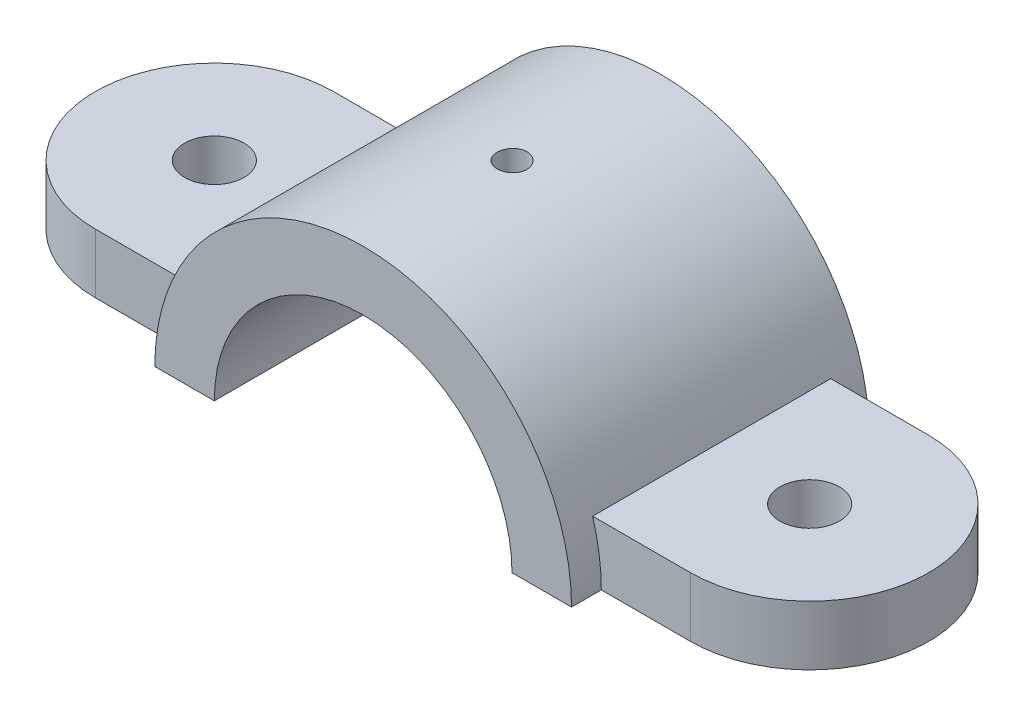
ISO-10303-21;
HEADER;
FILE_DESCRIPTION(('STEP AP214'),'2;1');
FILE_NAME('part.step','',(''),(''),'','','');
FILE_SCHEMA(('AUTOMOTIVE_DESIGN { 1 0 10303 214 1 1 1 1 }'));
ENDSEC;
DATA;
#1=APPLICATION_CONTEXT('core data for automotive mechanical design processes');
#2=APPLICATION_PROTOCOL_DEFINITION('international standard','automotive_design',2000,#1);
#3=PRODUCT_CONTEXT('',#1,'mechanical');
#4=PRODUCT('Part','Part','',(#3));
#5=PRODUCT_RELATED_PRODUCT_CATEGORY('part','',(#4));
#6=PRODUCT_DEFINITION_FORMATION('','',#4);
#7=PRODUCT_DEFINITION_CONTEXT('part definition',#1,'design');
#8=PRODUCT_DEFINITION('design','',#6,#7);
#9=PRODUCT_DEFINITION_SHAPE('','',#8);
#10=(LENGTH_UNIT() NAMED_UNIT(*) SI_UNIT(.MILLI.,.METRE.));
#11=(NAMED_UNIT(*) PLANE_ANGLE_UNIT() SI_UNIT($,.RADIAN.));
#12=(NAMED_UNIT(*) SI_UNIT($,.STERADIAN.) SOLID_ANGLE_UNIT());
#13=UNCERTAINTY_MEASURE_WITH_UNIT(LENGTH_MEASURE(1.E-05),#10,'distance_accuracy_value','');
#14=(GEOMETRIC_REPRESENTATION_CONTEXT(3) GLOBAL_UNCERTAINTY_ASSIGNED_CONTEXT((#13)) GLOBAL_UNIT_ASSIGNED_CONTEXT((#10,
#11,#12)) REPRESENTATION_CONTEXT('',''));
#15=CARTESIAN_POINT('',(0.,0.,0.));
#16=DIRECTION('',(0.,0.,1.));
#17=DIRECTION('',(1.,0.,0.));
#18=AXIS2_PLACEMENT_3D('',#15,#16,#17);
#19=CARTESIAN_POINT('',(-63.5,0.,0.));
#20=DIRECTION('',(0.,1.,0.));
#21=DIRECTION('',(0.,0.,1.));
#22=AXIS2_PLACEMENT_3D('',#19,#20,#21);
#23=PLANE('',#22);
#24=CARTESIAN_POINT('',(-63.5,0.,4.20088608509321E-13));
#25=DIRECTION('',(0.,1.,0.));
#26=DIRECTION('',(0.,0.,-1.));
#27=AXIS2_PLACEMENT_3D('',#24,#25,#26);
#28=CIRCLE('',#27,6.34999999999998);
#29=CARTESIAN_POINT('',(-63.5,0.,-6.34999999999956));
#30=VERTEX_POINT('',#29);
#31=EDGE_CURVE('E178',#30,#30,#28,.T.);
#32=ORIENTED_EDGE('',*,*,#31,.T.);
#33=EDGE_LOOP('',(#32));
#34=FACE_BOUND('',#33,.T.);
#35=DIRECTION('',(1.,0.,0.));
#36=VECTOR('',#35,1.);
#37=CARTESIAN_POINT('',(-44.45,0.,-31.75));
#38=LINE('',#37,#36);
#39=CARTESIAN_POINT('',(-44.45,0.,-31.75));
#40=VERTEX_POINT('',#39);
#41=CARTESIAN_POINT('',(-31.75,0.,-31.75));
#42=VERTEX_POINT('',#41);
#43=EDGE_CURVE('E153',#40,#42,#38,.T.);
#44=ORIENTED_EDGE('',*,*,#43,.T.);
#45=DIRECTION('',(0.,0.,1.));
#46=VECTOR('',#45,1.);
#47=CARTESIAN_POINT('',(-31.75,0.,-31.75));
#48=LINE('',#47,#46);
#49=CARTESIAN_POINT('',(-31.75,0.,31.75));
#50=VERTEX_POINT('',#49);
#51=EDGE_CURVE('E55',#42,#50,#48,.T.);
#52=ORIENTED_EDGE('',*,*,#51,.T.);
#53=DIRECTION('',(1.,0.,0.));
#54=VECTOR('',#53,1.);
#55=CARTESIAN_POINT('',(-44.45,0.,31.75));
#56=LINE('',#55,#54);
#57=CARTESIAN_POINT('',(-44.45,0.,31.75));
#58=VERTEX_POINT('',#57);
#59=EDGE_CURVE('E296',#58,#50,#56,.T.);
#60=ORIENTED_EDGE('',*,*,#59,.F.);
#61=DIRECTION('',(0.,0.,-1.));
#62=VECTOR('',#61,1.);
#63=CARTESIAN_POINT('',(-44.45,0.,31.75));
#64=LINE('',#63,#62);
#65=CARTESIAN_POINT('',(-44.45,0.,25.4));
#66=VERTEX_POINT('',#65);
#67=EDGE_CURVE('E164',#58,#66,#64,.T.);
#68=ORIENTED_EDGE('',*,*,#67,.T.);
#69=DIRECTION('',(1.,0.,0.));
#70=VECTOR('',#69,1.);
#71=CARTESIAN_POINT('',(-63.5,0.,25.4));
#72=LINE('',#71,#70);
#73=CARTESIAN_POINT('',(-63.5,0.,25.4));
#74=VERTEX_POINT('',#73);
#75=EDGE_CURVE('E204',#74,#66,#72,.T.);
#76=ORIENTED_EDGE('',*,*,#75,.F.);
#77=CARTESIAN_POINT('',(-63.5,0.,0.));
#78=DIRECTION('',(0.,1.,0.));
#79=DIRECTION('',(0.,0.,1.));
#80=AXIS2_PLACEMENT_3D('',#77,#78,#79);
#81=CIRCLE('',#80,25.4);
#82=CARTESIAN_POINT('',(-63.5,0.,-25.4));
#83=VERTEX_POINT('',#82);
#84=EDGE_CURVE('E184',#83,#74,#81,.T.);
#85=ORIENTED_EDGE('',*,*,#84,.F.);
#86=DIRECTION('',(-1.,0.,0.));
#87=VECTOR('',#86,1.);
#88=CARTESIAN_POINT('',(-63.5,0.,-25.4));
#89=LINE('',#88,#87);
#90=CARTESIAN_POINT('',(-44.45,0.,-25.4));
#91=VERTEX_POINT('',#90);
#92=EDGE_CURVE('E208',#91,#83,#89,.T.);
#93=ORIENTED_EDGE('',*,*,#92,.F.);
#94=EDGE_CURVE('E162',#91,#40,#64,.T.);
#95=ORIENTED_EDGE('',*,*,#94,.T.);
#96=EDGE_LOOP('',(#44,#52,#60,#68,#76,#85,#93,#95));
#97=FACE_BOUND('',#96,.T.);
#98=ADVANCED_FACE('F34',(#34,#97),#23,.F.);
#99=CARTESIAN_POINT('',(-63.5,12.7,0.));
#100=DIRECTION('',(0.,1.,0.));
#101=DIRECTION('',(0.,0.,1.));
#102=AXIS2_PLACEMENT_3D('',#99,#100,#101);
#103=PLANE('',#102);
#104=CARTESIAN_POINT('',(63.5,12.7,0.));
#105=DIRECTION('',(0.,1.,0.));
#106=DIRECTION('',(0.,0.,1.));
#107=AXIS2_PLACEMENT_3D('',#104,#105,#106);
#108=CIRCLE('',#107,6.35);
#109=CARTESIAN_POINT('',(63.5,12.7,6.34999999999997));
#110=VERTEX_POINT('',#109);
#111=EDGE_CURVE('E181',#110,#110,#108,.T.);
#112=ORIENTED_EDGE('',*,*,#111,.F.);
#113=EDGE_LOOP('',(#112));
#114=FACE_BOUND('',#113,.T.);
#115=DIRECTION('',(-1.,0.,0.));
#116=VECTOR('',#115,1.);
#117=CARTESIAN_POINT('',(-63.5,12.7,-25.4));
#118=LINE('',#117,#116);
#119=CARTESIAN_POINT('',(63.5,12.7,-25.4));
#120=VERTEX_POINT('',#119);
#121=CARTESIAN_POINT('',(42.597094971371,12.7,-25.4));
#122=VERTEX_POINT('',#121);
#123=EDGE_CURVE('E198',#120,#122,#118,.T.);
#124=ORIENTED_EDGE('',*,*,#123,.T.);
#125=DIRECTION('',(0.,0.,-1.));
#126=VECTOR('',#125,1.);
#127=CARTESIAN_POINT('',(42.597094971371,12.7,31.75));
#128=LINE('',#127,#126);
#129=CARTESIAN_POINT('',(42.597094971371,12.7,25.4));
#130=VERTEX_POINT('',#129);
#131=EDGE_CURVE('E63',#122,#130,#128,.F.);
#132=ORIENTED_EDGE('',*,*,#131,.T.);
#133=DIRECTION('',(1.,0.,0.));
#134=VECTOR('',#133,1.);
#135=CARTESIAN_POINT('',(-63.5,12.7,25.4));
#136=LINE('',#135,#134);
#137=CARTESIAN_POINT('',(63.5,12.7,25.4));
#138=VERTEX_POINT('',#137);
#139=EDGE_CURVE('E190',#130,#138,#136,.T.);
#140=ORIENTED_EDGE('',*,*,#139,.T.);
#141=CARTESIAN_POINT('',(63.5,12.7,0.));
#142=DIRECTION('',(0.,1.,0.));
#143=DIRECTION('',(0.,0.,1.));
#144=AXIS2_PLACEMENT_3D('',#141,#142,#143);
#145=CIRCLE('',#144,25.4);
#146=EDGE_CURVE('E195',#138,#120,#145,.T.);
#147=ORIENTED_EDGE('',*,*,#146,.T.);
#148=EDGE_LOOP('',(#124,#132,#140,#147));
#149=FACE_BOUND('',#148,.T.);
#150=ADVANCED_FACE('F245',(#114,#149),#103,.T.);
#151=CARTESIAN_POINT('',(-63.5,12.7,4.20088608509321E-13));
#152=DIRECTION('',(0.,1.,0.));
#153=DIRECTION('',(0.,0.,-1.));
#154=AXIS2_PLACEMENT_3D('',#151,#152,#153);
#155=CIRCLE('',#154,6.34999999999998);
#156=CARTESIAN_POINT('',(-63.5,12.7,-6.34999999999956));
#157=VERTEX_POINT('',#156);
#158=EDGE_CURVE('E174',#157,#157,#155,.T.);
#159=ORIENTED_EDGE('',*,*,#158,.F.);
#160=EDGE_LOOP('',(#159));
#161=FACE_BOUND('',#160,.T.);
#162=CARTESIAN_POINT('',(-63.5,12.7,25.4));
#163=VERTEX_POINT('',#162);
#164=CARTESIAN_POINT('',(-42.597094971371,12.7,25.4));
#165=VERTEX_POINT('',#164);
#166=EDGE_CURVE('E192',#163,#165,#136,.T.);
#167=ORIENTED_EDGE('',*,*,#166,.T.);
#168=DIRECTION('',(0.,0.,-1.));
#169=VECTOR('',#168,1.);
#170=CARTESIAN_POINT('',(-42.597094971371,12.7,31.75));
#171=LINE('',#170,#169);
#172=CARTESIAN_POINT('',(-42.597094971371,12.7,-25.4));
#173=VERTEX_POINT('',#172);
#174=EDGE_CURVE('E171',#165,#173,#171,.T.);
#175=ORIENTED_EDGE('',*,*,#174,.T.);
#176=CARTESIAN_POINT('',(-63.5,12.7,-25.4));
#177=VERTEX_POINT('',#176);
#178=EDGE_CURVE('E197',#173,#177,#118,.T.);
#179=ORIENTED_EDGE('',*,*,#178,.T.);
#180=CARTESIAN_POINT('',(-63.5,12.7,0.));
#181=DIRECTION('',(0.,1.,0.));
#182=DIRECTION('',(0.,0.,1.));
#183=AXIS2_PLACEMENT_3D('',#180,#181,#182);
#184=CIRCLE('',#183,25.4);
#185=EDGE_CURVE('E187',#177,#163,#184,.T.);
#186=ORIENTED_EDGE('',*,*,#185,.T.);
#187=EDGE_LOOP('',(#167,#175,#179,#186));
#188=FACE_BOUND('',#187,.T.);
#189=ADVANCED_FACE('F251',(#161,#188),#103,.T.);
#190=CARTESIAN_POINT('',(-63.5,12.7,25.4));
#191=DIRECTION('',(0.,0.,-1.));
#192=DIRECTION('',(-1.,0.,0.));
#193=AXIS2_PLACEMENT_3D('',#190,#191,#192);
#194=PLANE('',#193);
#195=CARTESIAN_POINT('',(0.,0.,25.4));
#196=DIRECTION('',(0.,0.,-1.));
#197=DIRECTION('',(-1.,0.,0.));
#198=AXIS2_PLACEMENT_3D('',#195,#196,#197);
#199=CIRCLE('',#198,44.45);
#200=CARTESIAN_POINT('',(44.45,0.,25.4));
#201=VERTEX_POINT('',#200);
#202=EDGE_CURVE('E168',#201,#130,#199,.F.);
#203=ORIENTED_EDGE('',*,*,#202,.F.);
#204=CARTESIAN_POINT('',(63.5,0.,25.4));
#205=VERTEX_POINT('',#204);
#206=EDGE_CURVE('E203',#201,#205,#72,.T.);
#207=ORIENTED_EDGE('',*,*,#206,.T.);
#208=DIRECTION('',(0.,-1.,0.));
#209=VECTOR('',#208,1.);
#210=CARTESIAN_POINT('',(63.5,12.7,25.4));
#211=LINE('',#210,#209);
#212=EDGE_CURVE('E215',#138,#205,#211,.T.);
#213=ORIENTED_EDGE('',*,*,#212,.F.);
#214=ORIENTED_EDGE('',*,*,#139,.F.);
#215=EDGE_LOOP('',(#203,#207,#213,#214));
#216=FACE_BOUND('',#215,.T.);
#217=ADVANCED_FACE('F275',(#216),#194,.F.);
#218=EDGE_CURVE('E172',#165,#66,#199,.F.);
#219=ORIENTED_EDGE('',*,*,#218,.F.);
#220=ORIENTED_EDGE('',*,*,#166,.F.);
#221=DIRECTION('',(0.,-1.,0.));
#222=VECTOR('',#221,1.);
#223=CARTESIAN_POINT('',(-63.5,12.7,25.4));
#224=LINE('',#223,#222);
#225=EDGE_CURVE('E218',#163,#74,#224,.T.);
#226=ORIENTED_EDGE('',*,*,#225,.T.);
#227=ORIENTED_EDGE('',*,*,#75,.T.);
#228=EDGE_LOOP('',(#219,#220,#226,#227));
#229=FACE_BOUND('',#228,.T.);
#230=ADVANCED_FACE('F269',(#229),#194,.F.);
#231=CARTESIAN_POINT('',(-63.5,12.7,-25.4));
#232=DIRECTION('',(0.,0.,1.));
#233=DIRECTION('',(1.,0.,0.));
#234=AXIS2_PLACEMENT_3D('',#231,#232,#233);
#235=PLANE('',#234);
#236=CARTESIAN_POINT('',(0.,0.,-25.4));
#237=DIRECTION('',(0.,0.,1.));
#238=DIRECTION('',(1.,0.,0.));
#239=AXIS2_PLACEMENT_3D('',#236,#237,#238);
#240=CIRCLE('',#239,44.45);
#241=EDGE_CURVE('E48',#91,#173,#240,.F.);
#242=ORIENTED_EDGE('',*,*,#241,.F.);
#243=ORIENTED_EDGE('',*,*,#92,.T.);
#244=DIRECTION('',(0.,-1.,0.));
#245=VECTOR('',#244,1.);
#246=CARTESIAN_POINT('',(-63.5,12.7,-25.4));
#247=LINE('',#246,#245);
#248=EDGE_CURVE('E200',#177,#83,#247,.T.);
#249=ORIENTED_EDGE('',*,*,#248,.F.);
#250=ORIENTED_EDGE('',*,*,#178,.F.);
#251=EDGE_LOOP('',(#242,#243,#249,#250));
#252=FACE_BOUND('',#251,.T.);
#253=ADVANCED_FACE('F264',(#252),#235,.F.);
#254=CARTESIAN_POINT('',(44.45,0.,-25.4));
#255=VERTEX_POINT('',#254);
#256=EDGE_CURVE('E221',#122,#255,#240,.F.);
#257=ORIENTED_EDGE('',*,*,#256,.F.);
#258=ORIENTED_EDGE('',*,*,#123,.F.);
#259=DIRECTION('',(0.,-1.,0.));
#260=VECTOR('',#259,1.);
#261=CARTESIAN_POINT('',(63.5,12.7,-25.4));
#262=LINE('',#261,#260);
#263=CARTESIAN_POINT('',(63.5,0.,-25.4));
#264=VERTEX_POINT('',#263);
#265=EDGE_CURVE('E212',#120,#264,#262,.T.);
#266=ORIENTED_EDGE('',*,*,#265,.T.);
#267=EDGE_CURVE('E191',#264,#255,#89,.T.);
#268=ORIENTED_EDGE('',*,*,#267,.T.);
#269=EDGE_LOOP('',(#257,#258,#266,#268));
#270=FACE_BOUND('',#269,.T.);
#271=ADVANCED_FACE('F257',(#270),#235,.F.);
#272=CARTESIAN_POINT('',(31.75,0.,31.75));
#273=VERTEX_POINT('',#272);
#274=CARTESIAN_POINT('',(44.45,0.,31.75));
#275=VERTEX_POINT('',#274);
#276=EDGE_CURVE('E147',#273,#275,#56,.T.);
#277=ORIENTED_EDGE('',*,*,#276,.F.);
#278=DIRECTION('',(0.,0.,1.));
#279=VECTOR('',#278,1.);
#280=CARTESIAN_POINT('',(31.75,0.,-31.75));
#281=LINE('',#280,#279);
#282=CARTESIAN_POINT('',(31.75,0.,-31.75));
#283=VERTEX_POINT('',#282);
#284=EDGE_CURVE('E131',#283,#273,#281,.T.);
#285=ORIENTED_EDGE('',*,*,#284,.F.);
#286=CARTESIAN_POINT('',(44.45,0.,-31.75));
#287=VERTEX_POINT('',#286);
#288=EDGE_CURVE('E144',#283,#287,#38,.T.);
#289=ORIENTED_EDGE('',*,*,#288,.T.);
#290=DIRECTION('',(0.,0.,-1.));
#291=VECTOR('',#290,1.);
#292=CARTESIAN_POINT('',(44.45,0.,31.75));
#293=LINE('',#292,#291);
#294=EDGE_CURVE('E163',#255,#287,#293,.T.);
#295=ORIENTED_EDGE('',*,*,#294,.F.);
#296=ORIENTED_EDGE('',*,*,#267,.F.);
#297=CARTESIAN_POINT('',(63.5,0.,0.));
#298=DIRECTION('',(0.,1.,0.));
#299=DIRECTION('',(0.,0.,1.));
#300=AXIS2_PLACEMENT_3D('',#297,#298,#299);
#301=CIRCLE('',#300,25.4);
#302=EDGE_CURVE('E206',#205,#264,#301,.T.);
#303=ORIENTED_EDGE('',*,*,#302,.F.);
#304=ORIENTED_EDGE('',*,*,#206,.F.);
#305=EDGE_CURVE('E159',#275,#201,#293,.T.);
#306=ORIENTED_EDGE('',*,*,#305,.F.);
#307=EDGE_LOOP('',(#277,#285,#289,#295,#296,#303,#304,#306));
#308=FACE_BOUND('',#307,.T.);
#309=CARTESIAN_POINT('',(63.5,0.,0.));
#310=DIRECTION('',(0.,1.,0.));
#311=DIRECTION('',(0.,0.,1.));
#312=AXIS2_PLACEMENT_3D('',#309,#310,#311);
#313=CIRCLE('',#312,6.35);
#314=CARTESIAN_POINT('',(63.5,0.,6.34999999999997));
#315=VERTEX_POINT('',#314);
#316=EDGE_CURVE('E177',#315,#315,#313,.T.);
#317=ORIENTED_EDGE('',*,*,#316,.T.);
#318=EDGE_LOOP('',(#317));
#319=FACE_BOUND('',#318,.T.);
#320=ADVANCED_FACE('F141',(#308,#319),#23,.F.);
#321=CARTESIAN_POINT('',(-63.5,12.7,0.));
#322=DIRECTION('',(0.,-1.,0.));
#323=DIRECTION('',(0.,0.,-1.));
#324=AXIS2_PLACEMENT_3D('',#321,#322,#323);
#325=CYLINDRICAL_SURFACE('',#324,25.4);
#326=ORIENTED_EDGE('',*,*,#84,.T.);
#327=ORIENTED_EDGE('',*,*,#225,.F.);
#328=ORIENTED_EDGE('',*,*,#185,.F.);
#329=ORIENTED_EDGE('',*,*,#248,.T.);
#330=EDGE_LOOP('',(#326,#327,#328,#329));
#331=FACE_BOUND('',#330,.T.);
#332=ADVANCED_FACE('F36',(#331),#325,.T.);
#333=CARTESIAN_POINT('',(63.5,12.7,0.));
#334=DIRECTION('',(0.,-1.,0.));
#335=DIRECTION('',(0.,0.,-1.));
#336=AXIS2_PLACEMENT_3D('',#333,#334,#335);
#337=CYLINDRICAL_SURFACE('',#336,25.4);
#338=ORIENTED_EDGE('',*,*,#302,.T.);
#339=ORIENTED_EDGE('',*,*,#265,.F.);
#340=ORIENTED_EDGE('',*,*,#146,.F.);
#341=ORIENTED_EDGE('',*,*,#212,.T.);
#342=EDGE_LOOP('',(#338,#339,#340,#341));
#343=FACE_BOUND('',#342,.T.);
#344=ADVANCED_FACE('F262',(#343),#337,.T.);
#345=CARTESIAN_POINT('',(63.5,12.7,0.));
#346=DIRECTION('',(0.,-1.,0.));
#347=DIRECTION('',(0.,0.,-1.));
#348=AXIS2_PLACEMENT_3D('',#345,#346,#347);
#349=CYLINDRICAL_SURFACE('',#348,6.35);
#350=ORIENTED_EDGE('',*,*,#111,.T.);
#351=EDGE_LOOP('',(#350));
#352=FACE_BOUND('',#351,.T.);
#353=ORIENTED_EDGE('',*,*,#316,.F.);
#354=EDGE_LOOP('',(#353));
#355=FACE_BOUND('',#354,.T.);
#356=ADVANCED_FACE('F273',(#352,#355),#349,.F.);
#357=CARTESIAN_POINT('',(-63.5,12.7,4.20088608509321E-13));
#358=DIRECTION('',(0.,-1.,0.));
#359=DIRECTION('',(0.,0.,-1.));
#360=AXIS2_PLACEMENT_3D('',#357,#358,#359);
#361=CYLINDRICAL_SURFACE('',#360,6.34999999999998);
#362=ORIENTED_EDGE('',*,*,#158,.T.);
#363=EDGE_LOOP('',(#362));
#364=FACE_BOUND('',#363,.T.);
#365=ORIENTED_EDGE('',*,*,#31,.F.);
#366=EDGE_LOOP('',(#365));
#367=FACE_BOUND('',#366,.T.);
#368=ADVANCED_FACE('F312',(#364,#367),#361,.F.);
#369=CARTESIAN_POINT('',(0.,0.,31.75));
#370=DIRECTION('',(0.,0.,-1.));
#371=DIRECTION('',(-1.,0.,0.));
#372=AXIS2_PLACEMENT_3D('',#369,#370,#371);
#373=CYLINDRICAL_SURFACE('',#372,44.45);
#374=CARTESIAN_POINT('',(0.,44.45,-3.175));
#375=CARTESIAN_POINT('',(0.17809755969062,44.4499985010204,-3.1749921852915));
#376=CARTESIAN_POINT('',(0.35631846093859,44.4489181935322,-3.15996439283334));
#377=CARTESIAN_POINT('',(0.707835270978344,44.4447124952987,-3.10023344384521));
#378=CARTESIAN_POINT('',(0.881125267556108,44.4415847492453,-3.05549610954538));
#379=CARTESIAN_POINT('',(1.21763791674399,44.4336378558182,-2.9376410589189));
#380=CARTESIAN_POINT('',(1.38086597659549,44.4288196263855,-2.86453874264178));
#381=CARTESIAN_POINT('',(1.69269346722433,44.418033060304,-2.69205484914637));
#382=CARTESIAN_POINT('',(1.84129615082639,44.4120649802704,-2.59267913359277));
#383=CARTESIAN_POINT('',(2.11997998340939,44.3996363409005,-2.37026268279305));
#384=CARTESIAN_POINT('',(2.25002939260178,44.3931749659727,-2.24718222035807));
#385=CARTESIAN_POINT('',(2.48764317829891,44.380494884107,-1.9809330348178));
#386=CARTESIAN_POINT('',(2.5952065966931,44.3742761875187,-1.83776345616511));
#387=CARTESIAN_POINT('',(2.78489768412392,44.3627762652838,-1.53521415441453));
#388=CARTESIAN_POINT('',(2.86699822922461,44.3574960418693,-1.37581738390362));
#389=CARTESIAN_POINT('',(3.00325964148284,44.3484793632232,-1.04545759664348));
#390=CARTESIAN_POINT('',(3.05742088477707,44.3447428872087,-0.874494735639384));
#391=CARTESIAN_POINT('',(3.13617617440064,44.3392430145078,-0.526167808778249));
#392=CARTESIAN_POINT('',(3.16082095687461,44.337476232457,-0.348815268475376));
#393=CARTESIAN_POINT('',(3.18000042163169,44.3361048630515,0.00751738406976762));
#394=CARTESIAN_POINT('',(3.17453553300967,44.3365002448835,0.186497473081446));
#395=CARTESIAN_POINT('',(3.1336928080948,44.3394054749584,0.540658150616265));
#396=CARTESIAN_POINT('',(3.09836996539516,44.3419114358203,0.715845117472151));
#397=CARTESIAN_POINT('',(2.9988993736118,44.3487493276067,1.05779706955871));
#398=CARTESIAN_POINT('',(2.93475140879975,44.353081272197,1.22456199174809));
#399=CARTESIAN_POINT('',(2.7793894028839,44.3630874612053,1.54511214283126));
#400=CARTESIAN_POINT('',(2.68815052276378,44.3687629365025,1.69888529294486));
#401=CARTESIAN_POINT('',(2.4812145802267,44.3808154538232,1.98895478384996));
#402=CARTESIAN_POINT('',(2.36551715598193,44.3871925062249,2.12525086604629));
#403=CARTESIAN_POINT('',(2.11263912589021,44.3999468565423,2.37681715563404));
#404=CARTESIAN_POINT('',(1.97541094694941,44.4063241229682,2.49203954889323));
#405=CARTESIAN_POINT('',(1.68353326582272,44.4183465899756,2.69781856552779));
#406=CARTESIAN_POINT('',(1.52888375563627,44.4239917902211,2.7883751775756));
#407=CARTESIAN_POINT('',(1.20652351982174,44.4339147067992,2.94224843922552));
#408=CARTESIAN_POINT('',(1.03881186894526,44.4381923261505,3.00556315708914));
#409=CARTESIAN_POINT('',(0.695101534536752,44.4448968658532,3.10312281529963));
#410=CARTESIAN_POINT('',(0.519102977405436,44.4473238144234,3.13736819889142));
#411=CARTESIAN_POINT('',(0.164229470601715,44.4500499204039,3.17575756562761));
#412=CARTESIAN_POINT('',(-0.0146382961204218,44.4503537489791,3.17996763115629));
#413=CARTESIAN_POINT('',(-0.370537321569539,44.4488118249658,3.15833969363806));
#414=CARTESIAN_POINT('',(-0.547568592818348,44.4469660870436,3.13250189560341));
#415=CARTESIAN_POINT('',(-0.894582312960256,44.4413357347358,3.05156640913193));
#416=CARTESIAN_POINT('',(-1.06457189733486,44.4375531376683,2.99649916218023));
#417=CARTESIAN_POINT('',(-1.39289741703371,44.4284743676534,2.85869891892336));
#418=CARTESIAN_POINT('',(-1.5512332159126,44.423178176988,2.77596559875991));
#419=CARTESIAN_POINT('',(-1.85205847074147,44.4116551142492,2.58501432949461));
#420=CARTESIAN_POINT('',(-1.99451993838108,44.4054266423692,2.47675238551611));
#421=CARTESIAN_POINT('',(-2.25927051769905,44.3927448859707,2.23788087230796));
#422=CARTESIAN_POINT('',(-2.38155937133055,44.3862915985778,2.10727101724873));
#423=CARTESIAN_POINT('',(-2.60271836127946,44.3738738792979,1.82712545316469));
#424=CARTESIAN_POINT('',(-2.70154552685789,44.3679103572931,1.67755577532192));
#425=CARTESIAN_POINT('',(-2.87268159958821,44.3571593354335,1.36390636365055));
#426=CARTESIAN_POINT('',(-2.94499071056565,44.3523718265397,1.19982674136168));
#427=CARTESIAN_POINT('',(-3.06096414564601,44.3445193603726,0.861970119106408));
#428=CARTESIAN_POINT('',(-3.10465522282774,44.3414527946903,0.688202341357345));
#429=CARTESIAN_POINT('',(-3.16223963020726,44.3373836261545,0.335774660840801));
#430=CARTESIAN_POINT('',(-3.17613336446705,44.3363809953135,0.157114824444557));
#431=CARTESIAN_POINT('',(-3.17372453217148,44.3365534587745,-0.199598343740229));
#432=CARTESIAN_POINT('',(-3.15748950229105,44.3377236824066,-0.377652137869705));
#433=CARTESIAN_POINT('',(-3.09542433897,44.3420996628091,-0.72849816555522));
#434=CARTESIAN_POINT('',(-3.0495941548471,44.3453054230655,-0.901290390100188));
#435=CARTESIAN_POINT('',(-2.92965566407163,44.3533900104309,-1.23671606520818));
#436=CARTESIAN_POINT('',(-2.85554804081302,44.3582687971069,-1.39934976116655));
#437=CARTESIAN_POINT('',(-2.68116669252534,44.3691496822712,-1.70987682459985));
#438=CARTESIAN_POINT('',(-2.58089353963294,44.375151756197,-1.85777051428274));
#439=CARTESIAN_POINT('',(-2.35677531436748,44.3876187401926,-2.13496369125892));
#440=CARTESIAN_POINT('',(-2.23288076532297,44.3940846036465,-2.26422313162537));
#441=CARTESIAN_POINT('',(-1.96511570862737,44.4067421131503,-2.50015779397602));
#442=CARTESIAN_POINT('',(-1.82124034274248,44.412933692025,-2.60682750740843));
#443=CARTESIAN_POINT('',(-1.51738984886767,44.4243532343972,-2.79465826526877));
#444=CARTESIAN_POINT('',(-1.35739121739497,44.429579758747,-2.87578133807944));
#445=CARTESIAN_POINT('',(-1.02612043812863,44.4384621486734,-3.00991083117564));
#446=CARTESIAN_POINT('',(-0.85486165953085,44.4421198394355,-3.06294994136929));
#447=CARTESIAN_POINT('',(-0.568807958256338,44.4465015797572,-3.12572942626643));
#448=CARTESIAN_POINT('',(-0.455858555116116,44.4478076013163,-3.14418173924639));
#449=CARTESIAN_POINT('',(-0.228623044805805,44.4495572918002,-3.16881952317773));
#450=CARTESIAN_POINT('',(-0.114336940124905,44.4500009623306,-3.17500501696856));
#451=CARTESIAN_POINT('',(0.,44.45,-3.175));
#452=B_SPLINE_CURVE_WITH_KNOTS('',3,(#374,#375,#376,#377,#378,#379,#380,#381,#382,#383,#384,
#385,#386,#387,#388,#389,#390,#391,#392,#393,#394,#395,#396,#397,#398,#399,#400,#401,#402,#403,
#404,#405,#406,#407,#408,#409,#410,#411,#412,#413,#414,#415,#416,#417,#418,#419,#420,#421,#422,
#423,#424,#425,#426,#427,#428,#429,#430,#431,#432,#433,#434,#435,#436,#437,#438,#439,#440,#441,
#442,#443,#444,#445,#446,#447,#448,#449,#450,#451),.UNSPECIFIED.,.T.,.F.,(4,2,2,2,2,2,2,2,2,2,2,
2,2,2,2,2,2,2,2,2,2,2,2,2,2,2,2,2,2,2,2,2,2,2,2,2,2,2,4),(0.,0.533875259235039,1.06836575339372,
1.60256646458327,2.13664809461002,2.67163271481404,3.20664012565184,3.74221550288008,
4.27778366966297,4.81242991554011,5.34706854215867,5.88072458989978,6.41438463160984,
6.94853549244861,7.48269425580817,8.01805033204644,8.5534066541421,9.08880093241042,
9.62418704691904,10.1583948641756,10.6925990366306,11.2262479419402,11.7599030943476,
12.2944847333891,12.8290732102362,13.3646333747321,13.9001894226693,14.4352440979471,
14.9702915176574,15.5041410228642,16.0379914423009,16.571828960744,17.105654807249,
17.6406113237351,18.1756981406486,18.7115765781027,19.2468298707823,19.5895733497411,
19.932316190549),.UNSPECIFIED.);
#453=CARTESIAN_POINT('',(0.,44.45,-3.175));
#454=VERTEX_POINT('',#453);
#455=EDGE_CURVE('E11',#454,#454,#452,.T.);
#456=ORIENTED_EDGE('',*,*,#455,.T.);
#457=EDGE_LOOP('',(#456));
#458=FACE_BOUND('',#457,.T.);
#459=ORIENTED_EDGE('',*,*,#174,.F.);
#460=ORIENTED_EDGE('',*,*,#218,.T.);
#461=ORIENTED_EDGE('',*,*,#67,.F.);
#462=CARTESIAN_POINT('',(0.,0.,31.75));
#463=DIRECTION('',(0.,0.,1.));
#464=DIRECTION('',(-1.,0.,0.));
#465=AXIS2_PLACEMENT_3D('',#462,#463,#464);
#466=CIRCLE('',#465,44.45);
#467=EDGE_CURVE('E155',#275,#58,#466,.T.);
#468=ORIENTED_EDGE('',*,*,#467,.F.);
#469=ORIENTED_EDGE('',*,*,#305,.T.);
#470=ORIENTED_EDGE('',*,*,#202,.T.);
#471=ORIENTED_EDGE('',*,*,#131,.F.);
#472=ORIENTED_EDGE('',*,*,#256,.T.);
#473=ORIENTED_EDGE('',*,*,#294,.T.);
#474=CARTESIAN_POINT('',(0.,0.,-31.75));
#475=DIRECTION('',(0.,0.,1.));
#476=DIRECTION('',(-1.,0.,0.));
#477=AXIS2_PLACEMENT_3D('',#474,#475,#476);
#478=CIRCLE('',#477,44.45);
#479=EDGE_CURVE('E152',#287,#40,#478,.T.);
#480=ORIENTED_EDGE('',*,*,#479,.T.);
#481=ORIENTED_EDGE('',*,*,#94,.F.);
#482=ORIENTED_EDGE('',*,*,#241,.T.);
#483=EDGE_LOOP('',(#459,#460,#461,#468,#469,#470,#471,#472,#473,#480,#481,#482));
#484=FACE_BOUND('',#483,.T.);
#485=ADVANCED_FACE('F227',(#458,#484),#373,.T.);
#486=CARTESIAN_POINT('',(0.,0.,31.75));
#487=DIRECTION('',(0.,0.,-1.));
#488=DIRECTION('',(-1.,0.,0.));
#489=AXIS2_PLACEMENT_3D('',#486,#487,#488);
#490=PLANE('',#489);
#491=ORIENTED_EDGE('',*,*,#59,.T.);
#492=CARTESIAN_POINT('',(0.,0.,31.75));
#493=DIRECTION('',(0.,0.,1.));
#494=DIRECTION('',(-1.,0.,0.));
#495=AXIS2_PLACEMENT_3D('',#492,#493,#494);
#496=CIRCLE('',#495,31.75);
#497=EDGE_CURVE('E137',#273,#50,#496,.T.);
#498=ORIENTED_EDGE('',*,*,#497,.F.);
#499=ORIENTED_EDGE('',*,*,#276,.T.);
#500=ORIENTED_EDGE('',*,*,#467,.T.);
#501=EDGE_LOOP('',(#491,#498,#499,#500));
#502=FACE_BOUND('',#501,.T.);
#503=ADVANCED_FACE('F237',(#502),#490,.F.);
#504=CARTESIAN_POINT('',(0.,0.,-31.75));
#505=DIRECTION('',(0.,0.,-1.));
#506=DIRECTION('',(-1.,0.,0.));
#507=AXIS2_PLACEMENT_3D('',#504,#505,#506);
#508=PLANE('',#507);
#509=CARTESIAN_POINT('',(0.,0.,-31.75));
#510=DIRECTION('',(0.,0.,1.));
#511=DIRECTION('',(-1.,0.,0.));
#512=AXIS2_PLACEMENT_3D('',#509,#510,#511);
#513=CIRCLE('',#512,31.75);
#514=EDGE_CURVE('E127',#283,#42,#513,.T.);
#515=ORIENTED_EDGE('',*,*,#514,.T.);
#516=ORIENTED_EDGE('',*,*,#43,.F.);
#517=ORIENTED_EDGE('',*,*,#479,.F.);
#518=ORIENTED_EDGE('',*,*,#288,.F.);
#519=EDGE_LOOP('',(#515,#516,#517,#518));
#520=FACE_BOUND('',#519,.T.);
#521=ADVANCED_FACE('F150',(#520),#508,.T.);
#522=CARTESIAN_POINT('',(0.,0.,0.));
#523=DIRECTION('',(0.,-1.,0.));
#524=DIRECTION('',(0.,0.,-1.));
#525=AXIS2_PLACEMENT_3D('',#522,#523,#524);
#526=CYLINDRICAL_SURFACE('',#525,3.175);
#527=CARTESIAN_POINT('',(0.,31.75,-3.175));
#528=CARTESIAN_POINT('',(0.177864623288194,31.7499979527844,-3.17499229776629));
#529=CARTESIAN_POINT('',(0.355846840907679,31.7484895126795,-3.16000362125378));
#530=CARTESIAN_POINT('',(0.706876915227456,31.7426170961329,-3.10043712432789));
#531=CARTESIAN_POINT('',(0.879919116361027,31.7382499737803,-3.05582670512193));
#532=CARTESIAN_POINT('',(1.21593506956459,31.7271531623775,-2.93832838610188));
#533=CARTESIAN_POINT('',(1.37891483365234,31.7204249004225,-2.86545756435384));
#534=CARTESIAN_POINT('',(1.69029431104929,31.7053581472692,-2.69354011731702));
#535=CARTESIAN_POINT('',(1.83869691562356,31.6970199763607,-2.59449869719956));
#536=CARTESIAN_POINT('',(2.11727907339021,31.679633882837,-2.37266893492228));
#537=CARTESIAN_POINT('',(2.24739880985078,31.6705837749702,-2.24980563689854));
#538=CARTESIAN_POINT('',(2.48520750554337,31.6528118817738,-1.98397960371488));
#539=CARTESIAN_POINT('',(2.59289542723742,31.6440901116461,-1.84101593936542));
#540=CARTESIAN_POINT('',(2.78299535615848,31.6279400318009,-1.5386731619045));
#541=CARTESIAN_POINT('',(2.86535325281924,31.6205145055712,-1.37925986499882));
#542=CARTESIAN_POINT('',(3.00210977155826,31.6078246921021,-1.04878001475169));
#543=CARTESIAN_POINT('',(3.05650908442734,31.6025603514655,-0.877713749445959));
#544=CARTESIAN_POINT('',(3.13562695708601,31.594808669317,-0.52939378225042));
#545=CARTESIAN_POINT('',(3.16044469828704,31.5923120501396,-0.352162818494239));
#546=CARTESIAN_POINT('',(3.18000153030476,31.5903496671717,0.00396514128160296));
#547=CARTESIAN_POINT('',(3.17474141171479,31.5908838237177,0.182862093387538));
#548=CARTESIAN_POINT('',(3.13437358980225,31.5949141690412,0.536560108276285));
#549=CARTESIAN_POINT('',(3.09937418009545,31.5983996107532,0.711373670368603));
#550=CARTESIAN_POINT('',(3.00068978267811,31.6079230136255,1.05263303316347));
#551=CARTESIAN_POINT('',(2.93700440746199,31.6139610092671,1.21907872079447));
#552=CARTESIAN_POINT('',(2.78263633807378,31.6279215501032,1.53921963967397));
#553=CARTESIAN_POINT('',(2.69190559763593,31.635847444084,1.69289155162858));
#554=CARTESIAN_POINT('',(2.48605683684649,31.6526878925189,1.98286755734522));
#555=CARTESIAN_POINT('',(2.3709381027184,31.6616024759059,2.1191711425921));
#556=CARTESIAN_POINT('',(2.11897630690832,31.6794637336874,2.37117062591516));
#557=CARTESIAN_POINT('',(1.98203972035308,31.6884103763227,2.48677303597155));
#558=CARTESIAN_POINT('',(1.69065410451533,31.705290573243,2.69336403449048));
#559=CARTESIAN_POINT('',(1.53620505559873,31.7132241263921,2.78435259535681));
#560=CARTESIAN_POINT('',(1.21411398557326,31.7271868524303,2.93912931448505));
#561=CARTESIAN_POINT('',(1.04646966978794,31.7332156931689,3.00291272929734));
#562=CARTESIAN_POINT('',(0.702777415022534,31.7426863062647,3.10140006055981));
#563=CARTESIAN_POINT('',(0.526729727515706,31.7461281559868,3.13610484662022));
#564=CARTESIAN_POINT('',(0.172037689616795,31.7500270404689,3.17533117705788));
#565=CARTESIAN_POINT('',(-0.00659225918493622,31.7504968325006,3.17998172820168));
#566=CARTESIAN_POINT('',(-0.362089043777346,31.7484328757783,3.15930640982017));
#567=CARTESIAN_POINT('',(-0.538955903354991,31.7458991676019,3.13398094527398));
#568=CARTESIAN_POINT('',(-0.88553355670009,31.7381211038694,3.05417951703649));
#569=CARTESIAN_POINT('',(-1.05525839548616,31.7328823658977,2.99976395703231));
#570=CARTESIAN_POINT('',(-1.3831707203935,31.7202819638243,2.86338907243166));
#571=CARTESIAN_POINT('',(-1.54135794774885,31.7129202521268,2.78142913029991));
#572=CARTESIAN_POINT('',(-1.84228797204655,31.6968655917409,2.59197208724207));
#573=CARTESIAN_POINT('',(-1.98497716970281,31.6881682594093,2.48439022766053));
#574=CARTESIAN_POINT('',(-2.25031815401521,31.6704323686073,2.24686473492255));
#575=CARTESIAN_POINT('',(-2.37296943759613,31.6613938015768,2.11692054050174));
#576=CARTESIAN_POINT('',(-2.59520089889168,31.643955766469,1.83779612545767));
#577=CARTESIAN_POINT('',(-2.69469640980755,31.6355587169125,1.68854832297717));
#578=CARTESIAN_POINT('',(-2.86720997151165,31.6203911806332,1.37538663153427));
#579=CARTESIAN_POINT('',(-2.94022838437107,31.6136206716682,1.21147294316434));
#580=CARTESIAN_POINT('',(-3.0575732875732,31.6024878373811,0.873922752196103));
#581=CARTESIAN_POINT('',(-3.10195015502765,31.5981212857808,0.700303907710692));
#582=CARTESIAN_POINT('',(-3.16091572263604,31.5922775977313,0.348033346474549));
#583=CARTESIAN_POINT('',(-3.17550527711846,31.5908003784134,0.169381774216235));
#584=CARTESIAN_POINT('',(-3.17447021464623,31.5909043411651,-0.187041435532537));
#585=CARTESIAN_POINT('',(-3.15897859945813,31.5924720602625,-0.364813478152938));
#586=CARTESIAN_POINT('',(-3.09849981315959,31.5984605484931,-0.715216112009314));
#587=CARTESIAN_POINT('',(-3.05351260886985,31.6028813208356,-0.887846697461484));
#588=CARTESIAN_POINT('',(-2.93535635399457,31.6140740673562,-1.22306508322694));
#589=CARTESIAN_POINT('',(-2.8621912032824,31.6208457161565,-1.38565426967437));
#590=CARTESIAN_POINT('',(-2.68976968684256,31.6359778708996,-1.69626563105553));
#591=CARTESIAN_POINT('',(-2.59051346722094,31.6443383679452,-1.8442878875555));
#592=CARTESIAN_POINT('',(-2.36822791620592,31.6617504689079,-2.12224516644839));
#593=CARTESIAN_POINT('',(-2.2450994877266,31.6708048550743,-2.2521007674655));
#594=CARTESIAN_POINT('',(-1.97876064503972,31.6885591376389,-2.48936583882141));
#595=CARTESIAN_POINT('',(-1.83554542754371,31.6972589486045,-2.59676992505901));
#596=CARTESIAN_POINT('',(-1.53270405346209,31.7133465956959,-2.78629571598842));
#597=CARTESIAN_POINT('',(-1.37303747917597,31.7207310728513,-2.86835307375095));
#598=CARTESIAN_POINT('',(-1.04222003614425,31.7333194786842,-3.00438319246578));
#599=CARTESIAN_POINT('',(-0.871082363196308,31.7385258646315,-3.05838761877751));
#600=CARTESIAN_POINT('',(-0.58247997996311,31.744863287316,-3.12331295924424));
#601=CARTESIAN_POINT('',(-0.466860105281314,31.7467805719657,-3.14266911565045));
#602=CARTESIAN_POINT('',(-0.234177144094968,31.7493495996875,-3.16851514524609));
#603=CARTESIAN_POINT('',(-0.117114063544321,31.7500013479788,-3.17500507149691));
#604=CARTESIAN_POINT('',(0.,31.75,-3.175));
#605=B_SPLINE_CURVE_WITH_KNOTS('',3,(#527,#528,#529,#530,#531,#532,#533,#534,#535,#536,#537,
#538,#539,#540,#541,#542,#543,#544,#545,#546,#547,#548,#549,#550,#551,#552,#553,#554,#555,#556,
#557,#558,#559,#560,#561,#562,#563,#564,#565,#566,#567,#568,#569,#570,#571,#572,#573,#574,#575,
#576,#577,#578,#579,#580,#581,#582,#583,#584,#585,#586,#587,#588,#589,#590,#591,#592,#593,#594,
#595,#596,#597,#598,#599,#600,#601,#602,#603,#604),.UNSPECIFIED.,.T.,.F.,(4,2,2,2,2,2,2,2,2,2,2,
2,2,2,2,2,2,2,2,2,2,2,2,2,2,2,2,2,2,2,2,2,2,2,2,2,2,2,4),(0.,0.533166212902403,1.06692015100267,
1.60035203719974,2.13367790682533,2.66870995537785,3.2037667452574,3.73995872124304,
4.27613744854949,4.81051336743498,5.3448752403709,5.87729956875525,6.40973108963186,
6.94311417358939,7.47651287051322,8.01226281072955,8.54801335160774,9.0838572670212,
9.61968515719519,10.1532114882963,10.6867306114828,11.2191461955942,11.7515737170706,
12.2857876187712,12.8200149304748,13.356165934573,13.8923096065931,14.4275076763278,
14.9626903958568,15.4955122300831,16.0283346636767,16.5610833802689,17.093829113612,
17.628835628328,18.1639702962234,18.7004525350832,19.2363278847506,19.587389934627,
19.9384505366916),.UNSPECIFIED.);
#606=CARTESIAN_POINT('',(0.,31.75,-3.175));
#607=VERTEX_POINT('',#606);
#608=EDGE_CURVE('E38',#607,#607,#605,.T.);
#609=ORIENTED_EDGE('',*,*,#608,.T.);
#610=EDGE_LOOP('',(#609));
#611=FACE_BOUND('',#610,.T.);
#612=ORIENTED_EDGE('',*,*,#455,.F.);
#613=EDGE_LOOP('',(#612));
#614=FACE_BOUND('',#613,.T.);
#615=ADVANCED_FACE('F231',(#611,#614),#526,.F.);
#616=CARTESIAN_POINT('',(0.,0.,-31.75));
#617=DIRECTION('',(0.,0.,1.));
#618=DIRECTION('',(1.,0.,0.));
#619=AXIS2_PLACEMENT_3D('',#616,#617,#618);
#620=CYLINDRICAL_SURFACE('',#619,31.75);
#621=ORIENTED_EDGE('',*,*,#497,.T.);
#622=ORIENTED_EDGE('',*,*,#51,.F.);
#623=ORIENTED_EDGE('',*,*,#514,.F.);
#624=ORIENTED_EDGE('',*,*,#284,.T.);
#625=EDGE_LOOP('',(#621,#622,#623,#624));
#626=FACE_BOUND('',#625,.T.);
#627=ORIENTED_EDGE('',*,*,#608,.F.);
#628=EDGE_LOOP('',(#627));
#629=FACE_BOUND('',#628,.T.);
#630=ADVANCED_FACE('F129',(#626,#629),#620,.F.);
#631=CLOSED_SHELL('',(#98,#150,#189,#217,#230,#253,#271,#320,#332,#344,#356,#368,#485,#503,#521,
#615,#630));
#632=MANIFOLD_SOLID_BREP('B2',#631);
#633=ADVANCED_BREP_SHAPE_REPRESENTATION('',(#18,#632),#14);
#634=SHAPE_DEFINITION_REPRESENTATION(#9,#633);
ENDSEC;
END-ISO-10303-21;
